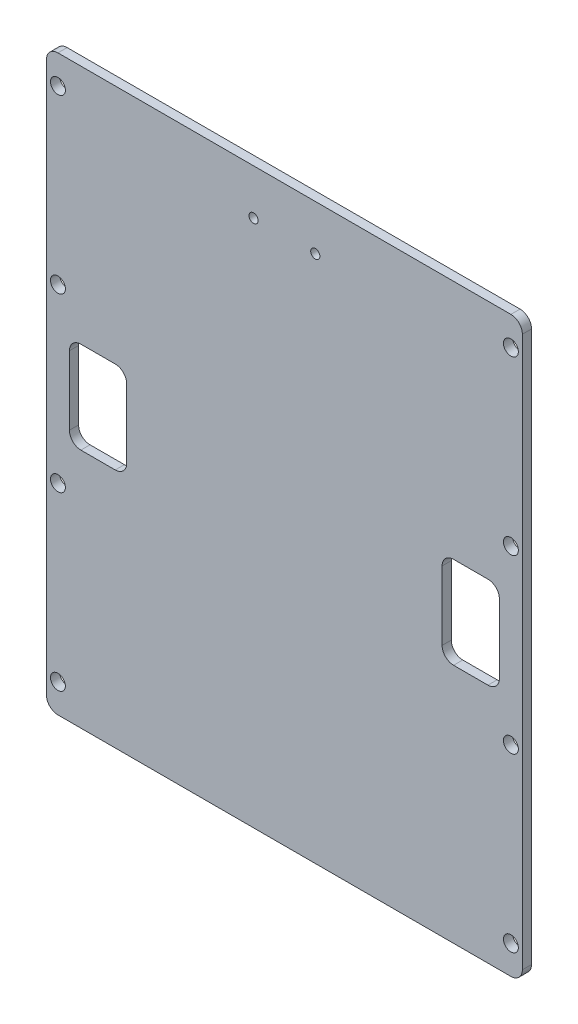
ISO-10303-21;
HEADER;
FILE_DESCRIPTION(('STEP AP214'),'2;1');
FILE_NAME('part.step','',(''),(''),'','','');
FILE_SCHEMA(('AUTOMOTIVE_DESIGN { 1 0 10303 214 1 1 1 1 }'));
ENDSEC;
DATA;
#1=APPLICATION_CONTEXT('core data for automotive mechanical design processes');
#2=APPLICATION_PROTOCOL_DEFINITION('international standard','automotive_design',2000,#1);
#3=PRODUCT_CONTEXT('',#1,'mechanical');
#4=PRODUCT('Part','Part','',(#3));
#5=PRODUCT_RELATED_PRODUCT_CATEGORY('part','',(#4));
#6=PRODUCT_DEFINITION_FORMATION('','',#4);
#7=PRODUCT_DEFINITION_CONTEXT('part definition',#1,'design');
#8=PRODUCT_DEFINITION('design','',#6,#7);
#9=PRODUCT_DEFINITION_SHAPE('','',#8);
#10=(LENGTH_UNIT() NAMED_UNIT(*) SI_UNIT(.MILLI.,.METRE.));
#11=(NAMED_UNIT(*) PLANE_ANGLE_UNIT() SI_UNIT($,.RADIAN.));
#12=(NAMED_UNIT(*) SI_UNIT($,.STERADIAN.) SOLID_ANGLE_UNIT());
#13=UNCERTAINTY_MEASURE_WITH_UNIT(LENGTH_MEASURE(1.E-05),#10,'distance_accuracy_value','');
#14=(GEOMETRIC_REPRESENTATION_CONTEXT(3) GLOBAL_UNCERTAINTY_ASSIGNED_CONTEXT((#13)) GLOBAL_UNIT_ASSIGNED_CONTEXT((#10,
#11,#12)) REPRESENTATION_CONTEXT('',''));
#15=CARTESIAN_POINT('',(0.,0.,0.));
#16=DIRECTION('',(0.,0.,1.));
#17=DIRECTION('',(1.,0.,0.));
#18=AXIS2_PLACEMENT_3D('',#15,#16,#17);
#19=CARTESIAN_POINT('',(-39.5,-48.,1.6));
#20=DIRECTION('',(0.,0.,-1.));
#21=DIRECTION('',(-1.,0.,0.));
#22=AXIS2_PLACEMENT_3D('',#19,#20,#21);
#23=CYLINDRICAL_SURFACE('',#22,2.);
#24=CARTESIAN_POINT('',(-39.5,-48.,0.));
#25=DIRECTION('',(0.,0.,1.));
#26=DIRECTION('',(-1.,0.,0.));
#27=AXIS2_PLACEMENT_3D('',#24,#25,#26);
#28=CIRCLE('',#27,2.);
#29=CARTESIAN_POINT('',(-41.5,-48.,0.));
#30=VERTEX_POINT('',#29);
#31=CARTESIAN_POINT('',(-39.5,-50.,0.));
#32=VERTEX_POINT('',#31);
#33=EDGE_CURVE('E395',#30,#32,#28,.T.);
#34=ORIENTED_EDGE('',*,*,#33,.T.);
#35=DIRECTION('',(0.,0.,-1.));
#36=VECTOR('',#35,1.);
#37=CARTESIAN_POINT('',(-39.5,-50.,1.6));
#38=LINE('',#37,#36);
#39=CARTESIAN_POINT('',(-39.5,-50.,1.6));
#40=VERTEX_POINT('',#39);
#41=EDGE_CURVE('E11',#40,#32,#38,.T.);
#42=ORIENTED_EDGE('',*,*,#41,.F.);
#43=CARTESIAN_POINT('',(-39.5,-48.,1.6));
#44=DIRECTION('',(0.,0.,1.));
#45=DIRECTION('',(-1.,0.,0.));
#46=AXIS2_PLACEMENT_3D('',#43,#44,#45);
#47=CIRCLE('',#46,2.);
#48=CARTESIAN_POINT('',(-41.5,-48.,1.6));
#49=VERTEX_POINT('',#48);
#50=EDGE_CURVE('E399',#49,#40,#47,.T.);
#51=ORIENTED_EDGE('',*,*,#50,.F.);
#52=DIRECTION('',(0.,0.,-1.));
#53=VECTOR('',#52,1.);
#54=CARTESIAN_POINT('',(-41.5,-48.,1.6));
#55=LINE('',#54,#53);
#56=EDGE_CURVE('E425',#49,#30,#55,.T.);
#57=ORIENTED_EDGE('',*,*,#56,.T.);
#58=EDGE_LOOP('',(#34,#42,#51,#57));
#59=FACE_BOUND('',#58,.T.);
#60=ADVANCED_FACE('F38',(#59),#23,.T.);
#61=CARTESIAN_POINT('',(-39.5,-50.,1.6));
#62=DIRECTION('',(0.,1.,0.));
#63=DIRECTION('',(0.,0.,1.));
#64=AXIS2_PLACEMENT_3D('',#61,#62,#63);
#65=PLANE('',#64);
#66=DIRECTION('',(1.,0.,0.));
#67=VECTOR('',#66,1.);
#68=CARTESIAN_POINT('',(-39.5,-50.,0.));
#69=LINE('',#68,#67);
#70=CARTESIAN_POINT('',(39.5,-50.,0.));
#71=VERTEX_POINT('',#70);
#72=EDGE_CURVE('E429',#32,#71,#69,.T.);
#73=ORIENTED_EDGE('',*,*,#72,.T.);
#74=DIRECTION('',(0.,0.,-1.));
#75=VECTOR('',#74,1.);
#76=CARTESIAN_POINT('',(39.5,-50.,1.6));
#77=LINE('',#76,#75);
#78=CARTESIAN_POINT('',(39.5,-50.,1.6));
#79=VERTEX_POINT('',#78);
#80=EDGE_CURVE('E46',#79,#71,#77,.T.);
#81=ORIENTED_EDGE('',*,*,#80,.F.);
#82=DIRECTION('',(1.,0.,0.));
#83=VECTOR('',#82,1.);
#84=CARTESIAN_POINT('',(-39.5,-50.,1.6));
#85=LINE('',#84,#83);
#86=EDGE_CURVE('E403',#40,#79,#85,.T.);
#87=ORIENTED_EDGE('',*,*,#86,.F.);
#88=ORIENTED_EDGE('',*,*,#41,.T.);
#89=EDGE_LOOP('',(#73,#81,#87,#88));
#90=FACE_BOUND('',#89,.T.);
#91=ADVANCED_FACE('F499',(#90),#65,.F.);
#92=CARTESIAN_POINT('',(39.5,-48.,1.6));
#93=DIRECTION('',(0.,0.,-1.));
#94=DIRECTION('',(-1.,0.,0.));
#95=AXIS2_PLACEMENT_3D('',#92,#93,#94);
#96=CYLINDRICAL_SURFACE('',#95,2.);
#97=CARTESIAN_POINT('',(39.5,-48.,0.));
#98=DIRECTION('',(0.,0.,1.));
#99=DIRECTION('',(1.,0.,0.));
#100=AXIS2_PLACEMENT_3D('',#97,#98,#99);
#101=CIRCLE('',#100,2.);
#102=CARTESIAN_POINT('',(41.5,-48.,0.));
#103=VERTEX_POINT('',#102);
#104=EDGE_CURVE('E432',#71,#103,#101,.T.);
#105=ORIENTED_EDGE('',*,*,#104,.T.);
#106=DIRECTION('',(0.,0.,-1.));
#107=VECTOR('',#106,1.);
#108=CARTESIAN_POINT('',(41.5,-48.,1.6));
#109=LINE('',#108,#107);
#110=CARTESIAN_POINT('',(41.5,-48.,1.6));
#111=VERTEX_POINT('',#110);
#112=EDGE_CURVE('E468',#111,#103,#109,.T.);
#113=ORIENTED_EDGE('',*,*,#112,.F.);
#114=CARTESIAN_POINT('',(39.5,-48.,1.6));
#115=DIRECTION('',(0.,0.,1.));
#116=DIRECTION('',(1.,0.,0.));
#117=AXIS2_PLACEMENT_3D('',#114,#115,#116);
#118=CIRCLE('',#117,2.);
#119=EDGE_CURVE('E407',#79,#111,#118,.T.);
#120=ORIENTED_EDGE('',*,*,#119,.F.);
#121=ORIENTED_EDGE('',*,*,#80,.T.);
#122=EDGE_LOOP('',(#105,#113,#120,#121));
#123=FACE_BOUND('',#122,.T.);
#124=ADVANCED_FACE('F477',(#123),#96,.T.);
#125=CARTESIAN_POINT('',(41.5,-48.,1.6));
#126=DIRECTION('',(-1.,0.,0.));
#127=DIRECTION('',(0.,0.,1.));
#128=AXIS2_PLACEMENT_3D('',#125,#126,#127);
#129=PLANE('',#128);
#130=DIRECTION('',(0.,1.,0.));
#131=VECTOR('',#130,1.);
#132=CARTESIAN_POINT('',(41.5,-48.,0.));
#133=LINE('',#132,#131);
#134=CARTESIAN_POINT('',(41.5,48.,0.));
#135=VERTEX_POINT('',#134);
#136=EDGE_CURVE('E435',#103,#135,#133,.T.);
#137=ORIENTED_EDGE('',*,*,#136,.T.);
#138=DIRECTION('',(0.,0.,-1.));
#139=VECTOR('',#138,1.);
#140=CARTESIAN_POINT('',(41.5,48.,1.6));
#141=LINE('',#140,#139);
#142=CARTESIAN_POINT('',(41.5,48.,1.6));
#143=VERTEX_POINT('',#142);
#144=EDGE_CURVE('E464',#143,#135,#141,.T.);
#145=ORIENTED_EDGE('',*,*,#144,.F.);
#146=DIRECTION('',(0.,1.,0.));
#147=VECTOR('',#146,1.);
#148=CARTESIAN_POINT('',(41.5,-48.,1.6));
#149=LINE('',#148,#147);
#150=EDGE_CURVE('E410',#111,#143,#149,.T.);
#151=ORIENTED_EDGE('',*,*,#150,.F.);
#152=ORIENTED_EDGE('',*,*,#112,.T.);
#153=EDGE_LOOP('',(#137,#145,#151,#152));
#154=FACE_BOUND('',#153,.T.);
#155=ADVANCED_FACE('F487',(#154),#129,.F.);
#156=CARTESIAN_POINT('',(39.5,48.,1.6));
#157=DIRECTION('',(0.,0.,-1.));
#158=DIRECTION('',(-1.,0.,0.));
#159=AXIS2_PLACEMENT_3D('',#156,#157,#158);
#160=CYLINDRICAL_SURFACE('',#159,2.);
#161=CARTESIAN_POINT('',(39.5,48.,0.));
#162=DIRECTION('',(0.,0.,1.));
#163=DIRECTION('',(-1.,0.,0.));
#164=AXIS2_PLACEMENT_3D('',#161,#162,#163);
#165=CIRCLE('',#164,2.);
#166=CARTESIAN_POINT('',(39.5,50.,0.));
#167=VERTEX_POINT('',#166);
#168=EDGE_CURVE('E438',#135,#167,#165,.T.);
#169=ORIENTED_EDGE('',*,*,#168,.T.);
#170=DIRECTION('',(0.,0.,-1.));
#171=VECTOR('',#170,1.);
#172=CARTESIAN_POINT('',(39.5,50.,1.6));
#173=LINE('',#172,#171);
#174=CARTESIAN_POINT('',(39.5,50.,1.6));
#175=VERTEX_POINT('',#174);
#176=EDGE_CURVE('E460',#175,#167,#173,.T.);
#177=ORIENTED_EDGE('',*,*,#176,.F.);
#178=CARTESIAN_POINT('',(39.5,48.,1.6));
#179=DIRECTION('',(0.,0.,1.));
#180=DIRECTION('',(-1.,0.,0.));
#181=AXIS2_PLACEMENT_3D('',#178,#179,#180);
#182=CIRCLE('',#181,2.);
#183=EDGE_CURVE('E413',#143,#175,#182,.T.);
#184=ORIENTED_EDGE('',*,*,#183,.F.);
#185=ORIENTED_EDGE('',*,*,#144,.T.);
#186=EDGE_LOOP('',(#169,#177,#184,#185));
#187=FACE_BOUND('',#186,.T.);
#188=ADVANCED_FACE('F491',(#187),#160,.T.);
#189=CARTESIAN_POINT('',(-39.5,50.,1.6));
#190=DIRECTION('',(0.,-1.,0.));
#191=DIRECTION('',(0.,0.,-1.));
#192=AXIS2_PLACEMENT_3D('',#189,#190,#191);
#193=PLANE('',#192);
#194=DIRECTION('',(-1.,0.,0.));
#195=VECTOR('',#194,1.);
#196=CARTESIAN_POINT('',(-39.5,50.,0.));
#197=LINE('',#196,#195);
#198=CARTESIAN_POINT('',(-39.5,50.,0.));
#199=VERTEX_POINT('',#198);
#200=EDGE_CURVE('E441',#167,#199,#197,.T.);
#201=ORIENTED_EDGE('',*,*,#200,.T.);
#202=DIRECTION('',(0.,0.,-1.));
#203=VECTOR('',#202,1.);
#204=CARTESIAN_POINT('',(-39.5,50.,1.6));
#205=LINE('',#204,#203);
#206=CARTESIAN_POINT('',(-39.5,50.,1.6));
#207=VERTEX_POINT('',#206);
#208=EDGE_CURVE('E456',#207,#199,#205,.T.);
#209=ORIENTED_EDGE('',*,*,#208,.F.);
#210=DIRECTION('',(-1.,0.,0.));
#211=VECTOR('',#210,1.);
#212=CARTESIAN_POINT('',(-39.5,50.,1.6));
#213=LINE('',#212,#211);
#214=EDGE_CURVE('E416',#175,#207,#213,.T.);
#215=ORIENTED_EDGE('',*,*,#214,.F.);
#216=ORIENTED_EDGE('',*,*,#176,.T.);
#217=EDGE_LOOP('',(#201,#209,#215,#216));
#218=FACE_BOUND('',#217,.T.);
#219=ADVANCED_FACE('F512',(#218),#193,.F.);
#220=CARTESIAN_POINT('',(-39.5,48.,1.6));
#221=DIRECTION('',(0.,0.,-1.));
#222=DIRECTION('',(-1.,0.,0.));
#223=AXIS2_PLACEMENT_3D('',#220,#221,#222);
#224=CYLINDRICAL_SURFACE('',#223,2.);
#225=CARTESIAN_POINT('',(-39.5,48.,0.));
#226=DIRECTION('',(0.,0.,1.));
#227=DIRECTION('',(-1.,0.,0.));
#228=AXIS2_PLACEMENT_3D('',#225,#226,#227);
#229=CIRCLE('',#228,2.);
#230=CARTESIAN_POINT('',(-41.5,48.,0.));
#231=VERTEX_POINT('',#230);
#232=EDGE_CURVE('E444',#199,#231,#229,.T.);
#233=ORIENTED_EDGE('',*,*,#232,.T.);
#234=DIRECTION('',(0.,0.,-1.));
#235=VECTOR('',#234,1.);
#236=CARTESIAN_POINT('',(-41.5,48.,1.6));
#237=LINE('',#236,#235);
#238=CARTESIAN_POINT('',(-41.5,48.,1.6));
#239=VERTEX_POINT('',#238);
#240=EDGE_CURVE('E452',#239,#231,#237,.T.);
#241=ORIENTED_EDGE('',*,*,#240,.F.);
#242=CARTESIAN_POINT('',(-39.5,48.,1.6));
#243=DIRECTION('',(0.,0.,1.));
#244=DIRECTION('',(-1.,0.,0.));
#245=AXIS2_PLACEMENT_3D('',#242,#243,#244);
#246=CIRCLE('',#245,2.);
#247=EDGE_CURVE('E419',#207,#239,#246,.T.);
#248=ORIENTED_EDGE('',*,*,#247,.F.);
#249=ORIENTED_EDGE('',*,*,#208,.T.);
#250=EDGE_LOOP('',(#233,#241,#248,#249));
#251=FACE_BOUND('',#250,.T.);
#252=ADVANCED_FACE('F510',(#251),#224,.T.);
#253=CARTESIAN_POINT('',(-41.5,-48.,1.6));
#254=DIRECTION('',(1.,0.,0.));
#255=DIRECTION('',(0.,0.,-1.));
#256=AXIS2_PLACEMENT_3D('',#253,#254,#255);
#257=PLANE('',#256);
#258=DIRECTION('',(0.,-1.,0.));
#259=VECTOR('',#258,1.);
#260=CARTESIAN_POINT('',(-41.5,-48.,0.));
#261=LINE('',#260,#259);
#262=EDGE_CURVE('E404',#231,#30,#261,.T.);
#263=ORIENTED_EDGE('',*,*,#262,.T.);
#264=ORIENTED_EDGE('',*,*,#56,.F.);
#265=DIRECTION('',(0.,-1.,0.));
#266=VECTOR('',#265,1.);
#267=CARTESIAN_POINT('',(-41.5,-48.,1.6));
#268=LINE('',#267,#266);
#269=EDGE_CURVE('E422',#239,#49,#268,.T.);
#270=ORIENTED_EDGE('',*,*,#269,.F.);
#271=ORIENTED_EDGE('',*,*,#240,.T.);
#272=EDGE_LOOP('',(#263,#264,#270,#271));
#273=FACE_BOUND('',#272,.T.);
#274=ADVANCED_FACE('F505',(#273),#257,.F.);
#275=CARTESIAN_POINT('',(-39.5,-48.,1.6));
#276=DIRECTION('',(0.,0.,-1.));
#277=DIRECTION('',(-1.,0.,0.));
#278=AXIS2_PLACEMENT_3D('',#275,#276,#277);
#279=PLANE('',#278);
#280=CARTESIAN_POINT('',(39.5,45.,1.6));
#281=DIRECTION('',(0.,0.,-1.));
#282=DIRECTION('',(-1.,0.,0.));
#283=AXIS2_PLACEMENT_3D('',#280,#281,#282);
#284=CIRCLE('',#283,1.3);
#285=CARTESIAN_POINT('',(38.2,45.,1.6));
#286=VERTEX_POINT('',#285);
#287=EDGE_CURVE('E891',#286,#286,#284,.T.);
#288=ORIENTED_EDGE('',*,*,#287,.T.);
#289=EDGE_LOOP('',(#288));
#290=FACE_BOUND('',#289,.T.);
#291=CARTESIAN_POINT('',(39.5,-15.,1.6));
#292=DIRECTION('',(0.,0.,-1.));
#293=DIRECTION('',(-1.,0.,0.));
#294=AXIS2_PLACEMENT_3D('',#291,#292,#293);
#295=CIRCLE('',#294,1.3);
#296=CARTESIAN_POINT('',(38.2,-15.,1.6));
#297=VERTEX_POINT('',#296);
#298=EDGE_CURVE('E905',#297,#297,#295,.T.);
#299=ORIENTED_EDGE('',*,*,#298,.T.);
#300=EDGE_LOOP('',(#299));
#301=FACE_BOUND('',#300,.T.);
#302=CARTESIAN_POINT('',(39.5,-45.,1.6));
#303=DIRECTION('',(0.,0.,-1.));
#304=DIRECTION('',(-1.,0.,0.));
#305=AXIS2_PLACEMENT_3D('',#302,#303,#304);
#306=CIRCLE('',#305,1.3);
#307=CARTESIAN_POINT('',(38.2,-45.,1.6));
#308=VERTEX_POINT('',#307);
#309=EDGE_CURVE('E913',#308,#308,#306,.T.);
#310=ORIENTED_EDGE('',*,*,#309,.T.);
#311=EDGE_LOOP('',(#310));
#312=FACE_BOUND('',#311,.T.);
#313=CARTESIAN_POINT('',(39.5,15.,1.6));
#314=DIRECTION('',(0.,0.,-1.));
#315=DIRECTION('',(-1.,0.,0.));
#316=AXIS2_PLACEMENT_3D('',#313,#314,#315);
#317=CIRCLE('',#316,1.3);
#318=CARTESIAN_POINT('',(38.2,15.,1.6));
#319=VERTEX_POINT('',#318);
#320=EDGE_CURVE('E920',#319,#319,#317,.T.);
#321=ORIENTED_EDGE('',*,*,#320,.T.);
#322=EDGE_LOOP('',(#321));
#323=FACE_BOUND('',#322,.T.);
#324=CARTESIAN_POINT('',(-39.5,45.,1.6));
#325=DIRECTION('',(0.,0.,-1.));
#326=DIRECTION('',(-1.,0.,0.));
#327=AXIS2_PLACEMENT_3D('',#324,#325,#326);
#328=CIRCLE('',#327,1.3);
#329=CARTESIAN_POINT('',(-40.8,45.,1.6));
#330=VERTEX_POINT('',#329);
#331=EDGE_CURVE('E928',#330,#330,#328,.T.);
#332=ORIENTED_EDGE('',*,*,#331,.T.);
#333=EDGE_LOOP('',(#332));
#334=FACE_BOUND('',#333,.T.);
#335=CARTESIAN_POINT('',(-39.5,-15.,1.6));
#336=DIRECTION('',(0.,0.,-1.));
#337=DIRECTION('',(-1.,0.,0.));
#338=AXIS2_PLACEMENT_3D('',#335,#336,#337);
#339=CIRCLE('',#338,1.3);
#340=CARTESIAN_POINT('',(-40.8,-15.,1.6));
#341=VERTEX_POINT('',#340);
#342=EDGE_CURVE('E936',#341,#341,#339,.T.);
#343=ORIENTED_EDGE('',*,*,#342,.T.);
#344=EDGE_LOOP('',(#343));
#345=FACE_BOUND('',#344,.T.);
#346=CARTESIAN_POINT('',(-39.5,-45.,1.6));
#347=DIRECTION('',(0.,0.,-1.));
#348=DIRECTION('',(-1.,0.,0.));
#349=AXIS2_PLACEMENT_3D('',#346,#347,#348);
#350=CIRCLE('',#349,1.3);
#351=CARTESIAN_POINT('',(-40.8,-45.,1.6));
#352=VERTEX_POINT('',#351);
#353=EDGE_CURVE('E944',#352,#352,#350,.T.);
#354=ORIENTED_EDGE('',*,*,#353,.T.);
#355=EDGE_LOOP('',(#354));
#356=FACE_BOUND('',#355,.T.);
#357=CARTESIAN_POINT('',(-39.5,15.,1.6));
#358=DIRECTION('',(0.,0.,-1.));
#359=DIRECTION('',(-1.,0.,0.));
#360=AXIS2_PLACEMENT_3D('',#357,#358,#359);
#361=CIRCLE('',#360,1.3);
#362=CARTESIAN_POINT('',(-40.8,15.,1.6));
#363=VERTEX_POINT('',#362);
#364=EDGE_CURVE('E230',#363,#363,#361,.T.);
#365=ORIENTED_EDGE('',*,*,#364,.T.);
#366=EDGE_LOOP('',(#365));
#367=FACE_BOUND('',#366,.T.);
#368=DIRECTION('',(0.,1.,0.));
#369=VECTOR('',#368,1.);
#370=CARTESIAN_POINT('',(-27.5,-6.,1.6));
#371=LINE('',#370,#369);
#372=CARTESIAN_POINT('',(-27.5,-6.,1.6));
#373=VERTEX_POINT('',#372);
#374=CARTESIAN_POINT('',(-27.5,6.,1.6));
#375=VERTEX_POINT('',#374);
#376=EDGE_CURVE('E254',#373,#375,#371,.T.);
#377=ORIENTED_EDGE('',*,*,#376,.F.);
#378=CARTESIAN_POINT('',(-29.5,-6.,1.6));
#379=DIRECTION('',(0.,0.,1.));
#380=DIRECTION('',(1.,0.,0.));
#381=AXIS2_PLACEMENT_3D('',#378,#379,#380);
#382=CIRCLE('',#381,2.);
#383=CARTESIAN_POINT('',(-29.5,-8.,1.6));
#384=VERTEX_POINT('',#383);
#385=EDGE_CURVE('E53',#384,#373,#382,.T.);
#386=ORIENTED_EDGE('',*,*,#385,.F.);
#387=DIRECTION('',(1.,0.,0.));
#388=VECTOR('',#387,1.);
#389=CARTESIAN_POINT('',(-29.5,-8.,1.6));
#390=LINE('',#389,#388);
#391=CARTESIAN_POINT('',(-35.5,-8.,1.6));
#392=VERTEX_POINT('',#391);
#393=EDGE_CURVE('E221',#392,#384,#390,.T.);
#394=ORIENTED_EDGE('',*,*,#393,.F.);
#395=CARTESIAN_POINT('',(-35.5,-6.,1.6));
#396=DIRECTION('',(0.,0.,1.));
#397=DIRECTION('',(-1.,0.,0.));
#398=AXIS2_PLACEMENT_3D('',#395,#396,#397);
#399=CIRCLE('',#398,2.);
#400=CARTESIAN_POINT('',(-37.5,-6.,1.6));
#401=VERTEX_POINT('',#400);
#402=EDGE_CURVE('E227',#401,#392,#399,.T.);
#403=ORIENTED_EDGE('',*,*,#402,.F.);
#404=DIRECTION('',(0.,-1.,0.));
#405=VECTOR('',#404,1.);
#406=CARTESIAN_POINT('',(-37.5,-6.,1.6));
#407=LINE('',#406,#405);
#408=CARTESIAN_POINT('',(-37.5,6.,1.6));
#409=VERTEX_POINT('',#408);
#410=EDGE_CURVE('E269',#409,#401,#407,.T.);
#411=ORIENTED_EDGE('',*,*,#410,.F.);
#412=CARTESIAN_POINT('',(-35.5,6.,1.6));
#413=DIRECTION('',(0.,0.,1.));
#414=DIRECTION('',(1.,0.,0.));
#415=AXIS2_PLACEMENT_3D('',#412,#413,#414);
#416=CIRCLE('',#415,2.);
#417=CARTESIAN_POINT('',(-35.5,8.,1.6));
#418=VERTEX_POINT('',#417);
#419=EDGE_CURVE('E265',#418,#409,#416,.T.);
#420=ORIENTED_EDGE('',*,*,#419,.F.);
#421=DIRECTION('',(-1.,0.,0.));
#422=VECTOR('',#421,1.);
#423=CARTESIAN_POINT('',(-29.5,8.,1.6));
#424=LINE('',#423,#422);
#425=CARTESIAN_POINT('',(-29.5,8.,1.6));
#426=VERTEX_POINT('',#425);
#427=EDGE_CURVE('E261',#426,#418,#424,.T.);
#428=ORIENTED_EDGE('',*,*,#427,.F.);
#429=CARTESIAN_POINT('',(-29.5,6.,1.6));
#430=DIRECTION('',(0.,0.,1.));
#431=DIRECTION('',(1.,0.,0.));
#432=AXIS2_PLACEMENT_3D('',#429,#430,#431);
#433=CIRCLE('',#432,2.);
#434=EDGE_CURVE('E257',#375,#426,#433,.T.);
#435=ORIENTED_EDGE('',*,*,#434,.F.);
#436=EDGE_LOOP('',(#377,#386,#394,#403,#411,#420,#428,#435));
#437=FACE_BOUND('',#436,.T.);
#438=DIRECTION('',(0.,-1.,0.));
#439=VECTOR('',#438,1.);
#440=CARTESIAN_POINT('',(27.5,-6.,1.6));
#441=LINE('',#440,#439);
#442=CARTESIAN_POINT('',(27.5,6.,1.6));
#443=VERTEX_POINT('',#442);
#444=CARTESIAN_POINT('',(27.5,-6.,1.6));
#445=VERTEX_POINT('',#444);
#446=EDGE_CURVE('E332',#443,#445,#441,.T.);
#447=ORIENTED_EDGE('',*,*,#446,.F.);
#448=CARTESIAN_POINT('',(29.5,6.,1.6));
#449=DIRECTION('',(0.,0.,1.));
#450=DIRECTION('',(-1.,0.,0.));
#451=AXIS2_PLACEMENT_3D('',#448,#449,#450);
#452=CIRCLE('',#451,2.);
#453=CARTESIAN_POINT('',(29.5,8.,1.6));
#454=VERTEX_POINT('',#453);
#455=EDGE_CURVE('E279',#454,#443,#452,.T.);
#456=ORIENTED_EDGE('',*,*,#455,.F.);
#457=DIRECTION('',(-1.,0.,0.));
#458=VECTOR('',#457,1.);
#459=CARTESIAN_POINT('',(29.5,8.,1.6));
#460=LINE('',#459,#458);
#461=CARTESIAN_POINT('',(35.5,8.,1.6));
#462=VERTEX_POINT('',#461);
#463=EDGE_CURVE('E302',#462,#454,#460,.T.);
#464=ORIENTED_EDGE('',*,*,#463,.F.);
#465=CARTESIAN_POINT('',(35.5,6.,1.6));
#466=DIRECTION('',(0.,0.,1.));
#467=DIRECTION('',(-1.,0.,0.));
#468=AXIS2_PLACEMENT_3D('',#465,#466,#467);
#469=CIRCLE('',#468,2.);
#470=CARTESIAN_POINT('',(37.5,6.,1.6));
#471=VERTEX_POINT('',#470);
#472=EDGE_CURVE('E352',#471,#462,#469,.T.);
#473=ORIENTED_EDGE('',*,*,#472,.F.);
#474=DIRECTION('',(0.,1.,0.));
#475=VECTOR('',#474,1.);
#476=CARTESIAN_POINT('',(37.5,-6.,1.6));
#477=LINE('',#476,#475);
#478=CARTESIAN_POINT('',(37.5,-6.,1.6));
#479=VERTEX_POINT('',#478);
#480=EDGE_CURVE('E348',#479,#471,#477,.T.);
#481=ORIENTED_EDGE('',*,*,#480,.F.);
#482=CARTESIAN_POINT('',(35.5,-6.,1.6));
#483=DIRECTION('',(0.,0.,1.));
#484=DIRECTION('',(1.,0.,0.));
#485=AXIS2_PLACEMENT_3D('',#482,#483,#484);
#486=CIRCLE('',#485,2.);
#487=CARTESIAN_POINT('',(35.5,-8.,1.6));
#488=VERTEX_POINT('',#487);
#489=EDGE_CURVE('E344',#488,#479,#486,.T.);
#490=ORIENTED_EDGE('',*,*,#489,.F.);
#491=DIRECTION('',(1.,0.,0.));
#492=VECTOR('',#491,1.);
#493=CARTESIAN_POINT('',(29.5,-8.,1.6));
#494=LINE('',#493,#492);
#495=CARTESIAN_POINT('',(29.5,-8.,1.6));
#496=VERTEX_POINT('',#495);
#497=EDGE_CURVE('E340',#496,#488,#494,.T.);
#498=ORIENTED_EDGE('',*,*,#497,.F.);
#499=CARTESIAN_POINT('',(29.5,-6.,1.6));
#500=DIRECTION('',(0.,0.,1.));
#501=DIRECTION('',(-1.,0.,0.));
#502=AXIS2_PLACEMENT_3D('',#499,#500,#501);
#503=CIRCLE('',#502,2.);
#504=EDGE_CURVE('E336',#445,#496,#503,.T.);
#505=ORIENTED_EDGE('',*,*,#504,.F.);
#506=EDGE_LOOP('',(#447,#456,#464,#473,#481,#490,#498,#505));
#507=FACE_BOUND('',#506,.T.);
#508=CARTESIAN_POINT('',(5.385,42.1,1.6));
#509=DIRECTION('',(0.,0.,1.));
#510=DIRECTION('',(1.,0.,0.));
#511=AXIS2_PLACEMENT_3D('',#508,#509,#510);
#512=CIRCLE('',#511,0.800000000000002);
#513=CARTESIAN_POINT('',(6.185,42.1,1.6));
#514=VERTEX_POINT('',#513);
#515=EDGE_CURVE('E362',#514,#514,#512,.T.);
#516=ORIENTED_EDGE('',*,*,#515,.F.);
#517=EDGE_LOOP('',(#516));
#518=FACE_BOUND('',#517,.T.);
#519=CARTESIAN_POINT('',(-5.385,42.1,1.6));
#520=DIRECTION('',(0.,0.,1.));
#521=DIRECTION('',(1.,0.,0.));
#522=AXIS2_PLACEMENT_3D('',#519,#520,#521);
#523=CIRCLE('',#522,0.800000000000001);
#524=CARTESIAN_POINT('',(-4.585,42.1,1.6));
#525=VERTEX_POINT('',#524);
#526=EDGE_CURVE('E387',#525,#525,#523,.T.);
#527=ORIENTED_EDGE('',*,*,#526,.F.);
#528=EDGE_LOOP('',(#527));
#529=FACE_BOUND('',#528,.T.);
#530=ORIENTED_EDGE('',*,*,#50,.T.);
#531=ORIENTED_EDGE('',*,*,#86,.T.);
#532=ORIENTED_EDGE('',*,*,#119,.T.);
#533=ORIENTED_EDGE('',*,*,#150,.T.);
#534=ORIENTED_EDGE('',*,*,#183,.T.);
#535=ORIENTED_EDGE('',*,*,#214,.T.);
#536=ORIENTED_EDGE('',*,*,#247,.T.);
#537=ORIENTED_EDGE('',*,*,#269,.T.);
#538=EDGE_LOOP('',(#530,#531,#532,#533,#534,#535,#536,#537));
#539=FACE_BOUND('',#538,.T.);
#540=ADVANCED_FACE('F495',(#290,#301,#312,#323,#334,#345,#356,#367,#437,#507,#518,#529,#539),
#279,.F.);
#541=CARTESIAN_POINT('',(-39.5,-48.,0.));
#542=DIRECTION('',(0.,0.,-1.));
#543=DIRECTION('',(-1.,0.,0.));
#544=AXIS2_PLACEMENT_3D('',#541,#542,#543);
#545=PLANE('',#544);
#546=CARTESIAN_POINT('',(39.5,45.,0.));
#547=DIRECTION('',(0.,0.,-1.));
#548=DIRECTION('',(-1.,0.,0.));
#549=AXIS2_PLACEMENT_3D('',#546,#547,#548);
#550=CIRCLE('',#549,1.3);
#551=CARTESIAN_POINT('',(38.2,45.,0.));
#552=VERTEX_POINT('',#551);
#553=EDGE_CURVE('E894',#552,#552,#550,.T.);
#554=ORIENTED_EDGE('',*,*,#553,.F.);
#555=EDGE_LOOP('',(#554));
#556=FACE_BOUND('',#555,.T.);
#557=CARTESIAN_POINT('',(39.5,-15.,0.));
#558=DIRECTION('',(0.,0.,-1.));
#559=DIRECTION('',(-1.,0.,0.));
#560=AXIS2_PLACEMENT_3D('',#557,#558,#559);
#561=CIRCLE('',#560,1.3);
#562=CARTESIAN_POINT('',(38.2,-15.,0.));
#563=VERTEX_POINT('',#562);
#564=EDGE_CURVE('E899',#563,#563,#561,.T.);
#565=ORIENTED_EDGE('',*,*,#564,.F.);
#566=EDGE_LOOP('',(#565));
#567=FACE_BOUND('',#566,.T.);
#568=CARTESIAN_POINT('',(39.5,-45.,0.));
#569=DIRECTION('',(0.,0.,-1.));
#570=DIRECTION('',(-1.,0.,0.));
#571=AXIS2_PLACEMENT_3D('',#568,#569,#570);
#572=CIRCLE('',#571,1.3);
#573=CARTESIAN_POINT('',(38.2,-45.,0.));
#574=VERTEX_POINT('',#573);
#575=EDGE_CURVE('E909',#574,#574,#572,.T.);
#576=ORIENTED_EDGE('',*,*,#575,.F.);
#577=EDGE_LOOP('',(#576));
#578=FACE_BOUND('',#577,.T.);
#579=CARTESIAN_POINT('',(39.5,15.,0.));
#580=DIRECTION('',(0.,0.,-1.));
#581=DIRECTION('',(-1.,0.,0.));
#582=AXIS2_PLACEMENT_3D('',#579,#580,#581);
#583=CIRCLE('',#582,1.3);
#584=CARTESIAN_POINT('',(38.2,15.,0.));
#585=VERTEX_POINT('',#584);
#586=EDGE_CURVE('E917',#585,#585,#583,.T.);
#587=ORIENTED_EDGE('',*,*,#586,.F.);
#588=EDGE_LOOP('',(#587));
#589=FACE_BOUND('',#588,.T.);
#590=CARTESIAN_POINT('',(-39.5,45.,0.));
#591=DIRECTION('',(0.,0.,-1.));
#592=DIRECTION('',(-1.,0.,0.));
#593=AXIS2_PLACEMENT_3D('',#590,#591,#592);
#594=CIRCLE('',#593,1.3);
#595=CARTESIAN_POINT('',(-40.8,45.,0.));
#596=VERTEX_POINT('',#595);
#597=EDGE_CURVE('E924',#596,#596,#594,.T.);
#598=ORIENTED_EDGE('',*,*,#597,.F.);
#599=EDGE_LOOP('',(#598));
#600=FACE_BOUND('',#599,.T.);
#601=CARTESIAN_POINT('',(-39.5,-15.,0.));
#602=DIRECTION('',(0.,0.,-1.));
#603=DIRECTION('',(-1.,0.,0.));
#604=AXIS2_PLACEMENT_3D('',#601,#602,#603);
#605=CIRCLE('',#604,1.3);
#606=CARTESIAN_POINT('',(-40.8,-15.,0.));
#607=VERTEX_POINT('',#606);
#608=EDGE_CURVE('E932',#607,#607,#605,.T.);
#609=ORIENTED_EDGE('',*,*,#608,.F.);
#610=EDGE_LOOP('',(#609));
#611=FACE_BOUND('',#610,.T.);
#612=CARTESIAN_POINT('',(-39.5,-45.,0.));
#613=DIRECTION('',(0.,0.,-1.));
#614=DIRECTION('',(-1.,0.,0.));
#615=AXIS2_PLACEMENT_3D('',#612,#613,#614);
#616=CIRCLE('',#615,1.3);
#617=CARTESIAN_POINT('',(-40.8,-45.,0.));
#618=VERTEX_POINT('',#617);
#619=EDGE_CURVE('E940',#618,#618,#616,.T.);
#620=ORIENTED_EDGE('',*,*,#619,.F.);
#621=EDGE_LOOP('',(#620));
#622=FACE_BOUND('',#621,.T.);
#623=CARTESIAN_POINT('',(-39.5,15.,0.));
#624=DIRECTION('',(0.,0.,-1.));
#625=DIRECTION('',(-1.,0.,0.));
#626=AXIS2_PLACEMENT_3D('',#623,#624,#625);
#627=CIRCLE('',#626,1.3);
#628=CARTESIAN_POINT('',(-40.8,15.,0.));
#629=VERTEX_POINT('',#628);
#630=EDGE_CURVE('E947',#629,#629,#627,.T.);
#631=ORIENTED_EDGE('',*,*,#630,.F.);
#632=EDGE_LOOP('',(#631));
#633=FACE_BOUND('',#632,.T.);
#634=CARTESIAN_POINT('',(-29.5,-6.,0.));
#635=DIRECTION('',(0.,0.,1.));
#636=DIRECTION('',(1.,0.,0.));
#637=AXIS2_PLACEMENT_3D('',#634,#635,#636);
#638=CIRCLE('',#637,2.);
#639=CARTESIAN_POINT('',(-29.5,-8.,0.));
#640=VERTEX_POINT('',#639);
#641=CARTESIAN_POINT('',(-27.5,-6.,0.));
#642=VERTEX_POINT('',#641);
#643=EDGE_CURVE('E201',#640,#642,#638,.T.);
#644=ORIENTED_EDGE('',*,*,#643,.T.);
#645=DIRECTION('',(0.,1.,0.));
#646=VECTOR('',#645,1.);
#647=CARTESIAN_POINT('',(-27.5,-6.,0.));
#648=LINE('',#647,#646);
#649=CARTESIAN_POINT('',(-27.5,6.,0.));
#650=VERTEX_POINT('',#649);
#651=EDGE_CURVE('E211',#642,#650,#648,.T.);
#652=ORIENTED_EDGE('',*,*,#651,.T.);
#653=CARTESIAN_POINT('',(-29.5,6.,0.));
#654=DIRECTION('',(0.,0.,1.));
#655=DIRECTION('',(1.,0.,0.));
#656=AXIS2_PLACEMENT_3D('',#653,#654,#655);
#657=CIRCLE('',#656,2.);
#658=CARTESIAN_POINT('',(-29.5,8.,0.));
#659=VERTEX_POINT('',#658);
#660=EDGE_CURVE('E61',#650,#659,#657,.T.);
#661=ORIENTED_EDGE('',*,*,#660,.T.);
#662=DIRECTION('',(-1.,0.,0.));
#663=VECTOR('',#662,1.);
#664=CARTESIAN_POINT('',(-29.5,8.,0.));
#665=LINE('',#664,#663);
#666=CARTESIAN_POINT('',(-35.5,8.,0.));
#667=VERTEX_POINT('',#666);
#668=EDGE_CURVE('E235',#659,#667,#665,.T.);
#669=ORIENTED_EDGE('',*,*,#668,.T.);
#670=CARTESIAN_POINT('',(-35.5,6.,0.));
#671=DIRECTION('',(0.,0.,1.));
#672=DIRECTION('',(1.,0.,0.));
#673=AXIS2_PLACEMENT_3D('',#670,#671,#672);
#674=CIRCLE('',#673,2.);
#675=CARTESIAN_POINT('',(-37.5,6.,0.));
#676=VERTEX_POINT('',#675);
#677=EDGE_CURVE('E239',#667,#676,#674,.T.);
#678=ORIENTED_EDGE('',*,*,#677,.T.);
#679=DIRECTION('',(0.,-1.,0.));
#680=VECTOR('',#679,1.);
#681=CARTESIAN_POINT('',(-37.5,-6.,0.));
#682=LINE('',#681,#680);
#683=CARTESIAN_POINT('',(-37.5,-6.,0.));
#684=VERTEX_POINT('',#683);
#685=EDGE_CURVE('E243',#676,#684,#682,.T.);
#686=ORIENTED_EDGE('',*,*,#685,.T.);
#687=CARTESIAN_POINT('',(-35.5,-6.,0.));
#688=DIRECTION('',(0.,0.,1.));
#689=DIRECTION('',(-1.,0.,0.));
#690=AXIS2_PLACEMENT_3D('',#687,#688,#689);
#691=CIRCLE('',#690,2.);
#692=CARTESIAN_POINT('',(-35.5,-8.,0.));
#693=VERTEX_POINT('',#692);
#694=EDGE_CURVE('E247',#684,#693,#691,.T.);
#695=ORIENTED_EDGE('',*,*,#694,.T.);
#696=DIRECTION('',(1.,0.,0.));
#697=VECTOR('',#696,1.);
#698=CARTESIAN_POINT('',(-29.5,-8.,0.));
#699=LINE('',#698,#697);
#700=EDGE_CURVE('E208',#693,#640,#699,.T.);
#701=ORIENTED_EDGE('',*,*,#700,.T.);
#702=EDGE_LOOP('',(#644,#652,#661,#669,#678,#686,#695,#701));
#703=FACE_BOUND('',#702,.T.);
#704=CARTESIAN_POINT('',(29.5,6.,0.));
#705=DIRECTION('',(0.,0.,1.));
#706=DIRECTION('',(-1.,0.,0.));
#707=AXIS2_PLACEMENT_3D('',#704,#705,#706);
#708=CIRCLE('',#707,2.);
#709=CARTESIAN_POINT('',(29.5,8.,0.));
#710=VERTEX_POINT('',#709);
#711=CARTESIAN_POINT('',(27.5,6.,0.));
#712=VERTEX_POINT('',#711);
#713=EDGE_CURVE('E297',#710,#712,#708,.T.);
#714=ORIENTED_EDGE('',*,*,#713,.T.);
#715=DIRECTION('',(0.,-1.,0.));
#716=VECTOR('',#715,1.);
#717=CARTESIAN_POINT('',(27.5,-6.,0.));
#718=LINE('',#717,#716);
#719=CARTESIAN_POINT('',(27.5,-6.,0.));
#720=VERTEX_POINT('',#719);
#721=EDGE_CURVE('E301',#712,#720,#718,.T.);
#722=ORIENTED_EDGE('',*,*,#721,.T.);
#723=CARTESIAN_POINT('',(29.5,-6.,0.));
#724=DIRECTION('',(0.,0.,1.));
#725=DIRECTION('',(-1.,0.,0.));
#726=AXIS2_PLACEMENT_3D('',#723,#724,#725);
#727=CIRCLE('',#726,2.);
#728=CARTESIAN_POINT('',(29.5,-8.,0.));
#729=VERTEX_POINT('',#728);
#730=EDGE_CURVE('E306',#720,#729,#727,.T.);
#731=ORIENTED_EDGE('',*,*,#730,.T.);
#732=DIRECTION('',(1.,0.,0.));
#733=VECTOR('',#732,1.);
#734=CARTESIAN_POINT('',(29.5,-8.,0.));
#735=LINE('',#734,#733);
#736=CARTESIAN_POINT('',(35.5,-8.,0.));
#737=VERTEX_POINT('',#736);
#738=EDGE_CURVE('E310',#729,#737,#735,.T.);
#739=ORIENTED_EDGE('',*,*,#738,.T.);
#740=CARTESIAN_POINT('',(35.5,-6.,0.));
#741=DIRECTION('',(0.,0.,1.));
#742=DIRECTION('',(1.,0.,0.));
#743=AXIS2_PLACEMENT_3D('',#740,#741,#742);
#744=CIRCLE('',#743,2.);
#745=CARTESIAN_POINT('',(37.5,-6.,0.));
#746=VERTEX_POINT('',#745);
#747=EDGE_CURVE('E314',#737,#746,#744,.T.);
#748=ORIENTED_EDGE('',*,*,#747,.T.);
#749=DIRECTION('',(0.,1.,0.));
#750=VECTOR('',#749,1.);
#751=CARTESIAN_POINT('',(37.5,-6.,0.));
#752=LINE('',#751,#750);
#753=CARTESIAN_POINT('',(37.5,6.,0.));
#754=VERTEX_POINT('',#753);
#755=EDGE_CURVE('E318',#746,#754,#752,.T.);
#756=ORIENTED_EDGE('',*,*,#755,.T.);
#757=CARTESIAN_POINT('',(35.5,6.,0.));
#758=DIRECTION('',(0.,0.,1.));
#759=DIRECTION('',(-1.,0.,0.));
#760=AXIS2_PLACEMENT_3D('',#757,#758,#759);
#761=CIRCLE('',#760,2.);
#762=CARTESIAN_POINT('',(35.5,8.,0.));
#763=VERTEX_POINT('',#762);
#764=EDGE_CURVE('E322',#754,#763,#761,.T.);
#765=ORIENTED_EDGE('',*,*,#764,.T.);
#766=DIRECTION('',(-1.,0.,0.));
#767=VECTOR('',#766,1.);
#768=CARTESIAN_POINT('',(29.5,8.,0.));
#769=LINE('',#768,#767);
#770=EDGE_CURVE('E326',#763,#710,#769,.T.);
#771=ORIENTED_EDGE('',*,*,#770,.T.);
#772=EDGE_LOOP('',(#714,#722,#731,#739,#748,#756,#765,#771));
#773=FACE_BOUND('',#772,.T.);
#774=CARTESIAN_POINT('',(5.385,42.1,0.));
#775=DIRECTION('',(0.,0.,1.));
#776=DIRECTION('',(1.,0.,0.));
#777=AXIS2_PLACEMENT_3D('',#774,#775,#776);
#778=CIRCLE('',#777,0.800000000000002);
#779=CARTESIAN_POINT('',(6.185,42.1,0.));
#780=VERTEX_POINT('',#779);
#781=EDGE_CURVE('E384',#780,#780,#778,.T.);
#782=ORIENTED_EDGE('',*,*,#781,.T.);
#783=EDGE_LOOP('',(#782));
#784=FACE_BOUND('',#783,.T.);
#785=CARTESIAN_POINT('',(-5.385,42.1,0.));
#786=DIRECTION('',(0.,0.,1.));
#787=DIRECTION('',(1.,0.,0.));
#788=AXIS2_PLACEMENT_3D('',#785,#786,#787);
#789=CIRCLE('',#788,0.800000000000001);
#790=CARTESIAN_POINT('',(-4.585,42.1,0.));
#791=VERTEX_POINT('',#790);
#792=EDGE_CURVE('E391',#791,#791,#789,.T.);
#793=ORIENTED_EDGE('',*,*,#792,.T.);
#794=EDGE_LOOP('',(#793));
#795=FACE_BOUND('',#794,.T.);
#796=ORIENTED_EDGE('',*,*,#33,.F.);
#797=ORIENTED_EDGE('',*,*,#262,.F.);
#798=ORIENTED_EDGE('',*,*,#232,.F.);
#799=ORIENTED_EDGE('',*,*,#200,.F.);
#800=ORIENTED_EDGE('',*,*,#168,.F.);
#801=ORIENTED_EDGE('',*,*,#136,.F.);
#802=ORIENTED_EDGE('',*,*,#104,.F.);
#803=ORIENTED_EDGE('',*,*,#72,.F.);
#804=EDGE_LOOP('',(#796,#797,#798,#799,#800,#801,#802,#803));
#805=FACE_BOUND('',#804,.T.);
#806=ADVANCED_FACE('F216',(#556,#567,#578,#589,#600,#611,#622,#633,#703,#773,#784,#795,#805),
#545,.T.);
#807=CARTESIAN_POINT('',(-5.385,42.1,0.));
#808=DIRECTION('',(0.,0.,1.));
#809=DIRECTION('',(1.,0.,0.));
#810=AXIS2_PLACEMENT_3D('',#807,#808,#809);
#811=CYLINDRICAL_SURFACE('',#810,0.800000000000001);
#812=ORIENTED_EDGE('',*,*,#792,.F.);
#813=EDGE_LOOP('',(#812));
#814=FACE_BOUND('',#813,.T.);
#815=ORIENTED_EDGE('',*,*,#526,.T.);
#816=EDGE_LOOP('',(#815));
#817=FACE_BOUND('',#816,.T.);
#818=ADVANCED_FACE('F569',(#814,#817),#811,.F.);
#819=CARTESIAN_POINT('',(5.385,42.1,0.));
#820=DIRECTION('',(0.,0.,1.));
#821=DIRECTION('',(1.,0.,0.));
#822=AXIS2_PLACEMENT_3D('',#819,#820,#821);
#823=CYLINDRICAL_SURFACE('',#822,0.800000000000002);
#824=ORIENTED_EDGE('',*,*,#781,.F.);
#825=EDGE_LOOP('',(#824));
#826=FACE_BOUND('',#825,.T.);
#827=ORIENTED_EDGE('',*,*,#515,.T.);
#828=EDGE_LOOP('',(#827));
#829=FACE_BOUND('',#828,.T.);
#830=ADVANCED_FACE('F577',(#826,#829),#823,.F.);
#831=CARTESIAN_POINT('',(29.5,6.,0.));
#832=DIRECTION('',(0.,0.,1.));
#833=DIRECTION('',(1.,0.,0.));
#834=AXIS2_PLACEMENT_3D('',#831,#832,#833);
#835=CYLINDRICAL_SURFACE('',#834,2.);
#836=ORIENTED_EDGE('',*,*,#455,.T.);
#837=DIRECTION('',(0.,0.,1.));
#838=VECTOR('',#837,1.);
#839=CARTESIAN_POINT('',(27.5,6.,0.));
#840=LINE('',#839,#838);
#841=EDGE_CURVE('E330',#712,#443,#840,.T.);
#842=ORIENTED_EDGE('',*,*,#841,.F.);
#843=ORIENTED_EDGE('',*,*,#713,.F.);
#844=DIRECTION('',(0.,0.,1.));
#845=VECTOR('',#844,1.);
#846=CARTESIAN_POINT('',(29.5,8.,0.));
#847=LINE('',#846,#845);
#848=EDGE_CURVE('E359',#710,#454,#847,.T.);
#849=ORIENTED_EDGE('',*,*,#848,.T.);
#850=EDGE_LOOP('',(#836,#842,#843,#849));
#851=FACE_BOUND('',#850,.T.);
#852=ADVANCED_FACE('F586',(#851),#835,.F.);
#853=CARTESIAN_POINT('',(29.5,8.,0.));
#854=DIRECTION('',(0.,1.,0.));
#855=DIRECTION('',(0.,0.,1.));
#856=AXIS2_PLACEMENT_3D('',#853,#854,#855);
#857=PLANE('',#856);
#858=ORIENTED_EDGE('',*,*,#463,.T.);
#859=ORIENTED_EDGE('',*,*,#848,.F.);
#860=ORIENTED_EDGE('',*,*,#770,.F.);
#861=DIRECTION('',(0.,0.,1.));
#862=VECTOR('',#861,1.);
#863=CARTESIAN_POINT('',(35.5,8.,0.));
#864=LINE('',#863,#862);
#865=EDGE_CURVE('E363',#763,#462,#864,.T.);
#866=ORIENTED_EDGE('',*,*,#865,.T.);
#867=EDGE_LOOP('',(#858,#859,#860,#866));
#868=FACE_BOUND('',#867,.T.);
#869=ADVANCED_FACE('F595',(#868),#857,.F.);
#870=CARTESIAN_POINT('',(35.5,6.,0.));
#871=DIRECTION('',(0.,0.,1.));
#872=DIRECTION('',(1.,0.,0.));
#873=AXIS2_PLACEMENT_3D('',#870,#871,#872);
#874=CYLINDRICAL_SURFACE('',#873,2.);
#875=ORIENTED_EDGE('',*,*,#472,.T.);
#876=ORIENTED_EDGE('',*,*,#865,.F.);
#877=ORIENTED_EDGE('',*,*,#764,.F.);
#878=DIRECTION('',(0.,0.,1.));
#879=VECTOR('',#878,1.);
#880=CARTESIAN_POINT('',(37.5,6.,0.));
#881=LINE('',#880,#879);
#882=EDGE_CURVE('E366',#754,#471,#881,.T.);
#883=ORIENTED_EDGE('',*,*,#882,.T.);
#884=EDGE_LOOP('',(#875,#876,#877,#883));
#885=FACE_BOUND('',#884,.T.);
#886=ADVANCED_FACE('F604',(#885),#874,.F.);
#887=CARTESIAN_POINT('',(37.5,-6.,0.));
#888=DIRECTION('',(1.,0.,0.));
#889=DIRECTION('',(0.,0.,-1.));
#890=AXIS2_PLACEMENT_3D('',#887,#888,#889);
#891=PLANE('',#890);
#892=ORIENTED_EDGE('',*,*,#480,.T.);
#893=ORIENTED_EDGE('',*,*,#882,.F.);
#894=ORIENTED_EDGE('',*,*,#755,.F.);
#895=DIRECTION('',(0.,0.,1.));
#896=VECTOR('',#895,1.);
#897=CARTESIAN_POINT('',(37.5,-6.,0.));
#898=LINE('',#897,#896);
#899=EDGE_CURVE('E369',#746,#479,#898,.T.);
#900=ORIENTED_EDGE('',*,*,#899,.T.);
#901=EDGE_LOOP('',(#892,#893,#894,#900));
#902=FACE_BOUND('',#901,.T.);
#903=ADVANCED_FACE('F613',(#902),#891,.F.);
#904=CARTESIAN_POINT('',(35.5,-6.,0.));
#905=DIRECTION('',(0.,0.,1.));
#906=DIRECTION('',(1.,0.,0.));
#907=AXIS2_PLACEMENT_3D('',#904,#905,#906);
#908=CYLINDRICAL_SURFACE('',#907,2.);
#909=ORIENTED_EDGE('',*,*,#489,.T.);
#910=ORIENTED_EDGE('',*,*,#899,.F.);
#911=ORIENTED_EDGE('',*,*,#747,.F.);
#912=DIRECTION('',(0.,0.,1.));
#913=VECTOR('',#912,1.);
#914=CARTESIAN_POINT('',(35.5,-8.,0.));
#915=LINE('',#914,#913);
#916=EDGE_CURVE('E372',#737,#488,#915,.T.);
#917=ORIENTED_EDGE('',*,*,#916,.T.);
#918=EDGE_LOOP('',(#909,#910,#911,#917));
#919=FACE_BOUND('',#918,.T.);
#920=ADVANCED_FACE('F622',(#919),#908,.F.);
#921=CARTESIAN_POINT('',(29.5,-8.,0.));
#922=DIRECTION('',(0.,-1.,0.));
#923=DIRECTION('',(0.,0.,-1.));
#924=AXIS2_PLACEMENT_3D('',#921,#922,#923);
#925=PLANE('',#924);
#926=ORIENTED_EDGE('',*,*,#497,.T.);
#927=ORIENTED_EDGE('',*,*,#916,.F.);
#928=ORIENTED_EDGE('',*,*,#738,.F.);
#929=DIRECTION('',(0.,0.,1.));
#930=VECTOR('',#929,1.);
#931=CARTESIAN_POINT('',(29.5,-8.,0.));
#932=LINE('',#931,#930);
#933=EDGE_CURVE('E375',#729,#496,#932,.T.);
#934=ORIENTED_EDGE('',*,*,#933,.T.);
#935=EDGE_LOOP('',(#926,#927,#928,#934));
#936=FACE_BOUND('',#935,.T.);
#937=ADVANCED_FACE('F631',(#936),#925,.F.);
#938=CARTESIAN_POINT('',(29.5,-6.,0.));
#939=DIRECTION('',(0.,0.,1.));
#940=DIRECTION('',(1.,0.,0.));
#941=AXIS2_PLACEMENT_3D('',#938,#939,#940);
#942=CYLINDRICAL_SURFACE('',#941,2.);
#943=ORIENTED_EDGE('',*,*,#504,.T.);
#944=ORIENTED_EDGE('',*,*,#933,.F.);
#945=ORIENTED_EDGE('',*,*,#730,.F.);
#946=DIRECTION('',(0.,0.,1.));
#947=VECTOR('',#946,1.);
#948=CARTESIAN_POINT('',(27.5,-6.,0.));
#949=LINE('',#948,#947);
#950=EDGE_CURVE('E378',#720,#445,#949,.T.);
#951=ORIENTED_EDGE('',*,*,#950,.T.);
#952=EDGE_LOOP('',(#943,#944,#945,#951));
#953=FACE_BOUND('',#952,.T.);
#954=ADVANCED_FACE('F640',(#953),#942,.F.);
#955=CARTESIAN_POINT('',(27.5,-6.,0.));
#956=DIRECTION('',(-1.,0.,0.));
#957=DIRECTION('',(0.,0.,1.));
#958=AXIS2_PLACEMENT_3D('',#955,#956,#957);
#959=PLANE('',#958);
#960=ORIENTED_EDGE('',*,*,#446,.T.);
#961=ORIENTED_EDGE('',*,*,#950,.F.);
#962=ORIENTED_EDGE('',*,*,#721,.F.);
#963=ORIENTED_EDGE('',*,*,#841,.T.);
#964=EDGE_LOOP('',(#960,#961,#962,#963));
#965=FACE_BOUND('',#964,.T.);
#966=ADVANCED_FACE('F649',(#965),#959,.F.);
#967=CARTESIAN_POINT('',(-29.5,-6.,0.));
#968=DIRECTION('',(0.,0.,1.));
#969=DIRECTION('',(1.,0.,0.));
#970=AXIS2_PLACEMENT_3D('',#967,#968,#969);
#971=CYLINDRICAL_SURFACE('',#970,2.);
#972=ORIENTED_EDGE('',*,*,#385,.T.);
#973=DIRECTION('',(0.,0.,1.));
#974=VECTOR('',#973,1.);
#975=CARTESIAN_POINT('',(-27.5,-6.,0.));
#976=LINE('',#975,#974);
#977=EDGE_CURVE('E197',#642,#373,#976,.T.);
#978=ORIENTED_EDGE('',*,*,#977,.F.);
#979=ORIENTED_EDGE('',*,*,#643,.F.);
#980=DIRECTION('',(0.,0.,1.));
#981=VECTOR('',#980,1.);
#982=CARTESIAN_POINT('',(-29.5,-8.,0.));
#983=LINE('',#982,#981);
#984=EDGE_CURVE('E276',#640,#384,#983,.T.);
#985=ORIENTED_EDGE('',*,*,#984,.T.);
#986=EDGE_LOOP('',(#972,#978,#979,#985));
#987=FACE_BOUND('',#986,.T.);
#988=ADVANCED_FACE('F199',(#987),#971,.F.);
#989=CARTESIAN_POINT('',(-29.5,-8.,0.));
#990=DIRECTION('',(0.,-1.,0.));
#991=DIRECTION('',(0.,0.,-1.));
#992=AXIS2_PLACEMENT_3D('',#989,#990,#991);
#993=PLANE('',#992);
#994=ORIENTED_EDGE('',*,*,#393,.T.);
#995=ORIENTED_EDGE('',*,*,#984,.F.);
#996=ORIENTED_EDGE('',*,*,#700,.F.);
#997=DIRECTION('',(0.,0.,1.));
#998=VECTOR('',#997,1.);
#999=CARTESIAN_POINT('',(-35.5,-8.,0.));
#1000=LINE('',#999,#998);
#1001=EDGE_CURVE('E280',#693,#392,#1000,.T.);
#1002=ORIENTED_EDGE('',*,*,#1001,.T.);
#1003=EDGE_LOOP('',(#994,#995,#996,#1002));
#1004=FACE_BOUND('',#1003,.T.);
#1005=ADVANCED_FACE('F666',(#1004),#993,.F.);
#1006=CARTESIAN_POINT('',(-35.5,-6.,0.));
#1007=DIRECTION('',(0.,0.,1.));
#1008=DIRECTION('',(1.,0.,0.));
#1009=AXIS2_PLACEMENT_3D('',#1006,#1007,#1008);
#1010=CYLINDRICAL_SURFACE('',#1009,2.);
#1011=ORIENTED_EDGE('',*,*,#402,.T.);
#1012=ORIENTED_EDGE('',*,*,#1001,.F.);
#1013=ORIENTED_EDGE('',*,*,#694,.F.);
#1014=DIRECTION('',(0.,0.,1.));
#1015=VECTOR('',#1014,1.);
#1016=CARTESIAN_POINT('',(-37.5,-6.,0.));
#1017=LINE('',#1016,#1015);
#1018=EDGE_CURVE('E283',#684,#401,#1017,.T.);
#1019=ORIENTED_EDGE('',*,*,#1018,.T.);
#1020=EDGE_LOOP('',(#1011,#1012,#1013,#1019));
#1021=FACE_BOUND('',#1020,.T.);
#1022=ADVANCED_FACE('F674',(#1021),#1010,.F.);
#1023=CARTESIAN_POINT('',(-37.5,-6.,0.));
#1024=DIRECTION('',(-1.,0.,0.));
#1025=DIRECTION('',(0.,0.,1.));
#1026=AXIS2_PLACEMENT_3D('',#1023,#1024,#1025);
#1027=PLANE('',#1026);
#1028=ORIENTED_EDGE('',*,*,#410,.T.);
#1029=ORIENTED_EDGE('',*,*,#1018,.F.);
#1030=ORIENTED_EDGE('',*,*,#685,.F.);
#1031=DIRECTION('',(0.,0.,1.));
#1032=VECTOR('',#1031,1.);
#1033=CARTESIAN_POINT('',(-37.5,6.,0.));
#1034=LINE('',#1033,#1032);
#1035=EDGE_CURVE('E286',#676,#409,#1034,.T.);
#1036=ORIENTED_EDGE('',*,*,#1035,.T.);
#1037=EDGE_LOOP('',(#1028,#1029,#1030,#1036));
#1038=FACE_BOUND('',#1037,.T.);
#1039=ADVANCED_FACE('F683',(#1038),#1027,.F.);
#1040=CARTESIAN_POINT('',(-35.5,6.,0.));
#1041=DIRECTION('',(0.,0.,1.));
#1042=DIRECTION('',(1.,0.,0.));
#1043=AXIS2_PLACEMENT_3D('',#1040,#1041,#1042);
#1044=CYLINDRICAL_SURFACE('',#1043,2.);
#1045=ORIENTED_EDGE('',*,*,#419,.T.);
#1046=ORIENTED_EDGE('',*,*,#1035,.F.);
#1047=ORIENTED_EDGE('',*,*,#677,.F.);
#1048=DIRECTION('',(0.,0.,1.));
#1049=VECTOR('',#1048,1.);
#1050=CARTESIAN_POINT('',(-35.5,8.,0.));
#1051=LINE('',#1050,#1049);
#1052=EDGE_CURVE('E289',#667,#418,#1051,.T.);
#1053=ORIENTED_EDGE('',*,*,#1052,.T.);
#1054=EDGE_LOOP('',(#1045,#1046,#1047,#1053));
#1055=FACE_BOUND('',#1054,.T.);
#1056=ADVANCED_FACE('F692',(#1055),#1044,.F.);
#1057=CARTESIAN_POINT('',(-29.5,8.,0.));
#1058=DIRECTION('',(0.,1.,0.));
#1059=DIRECTION('',(0.,0.,1.));
#1060=AXIS2_PLACEMENT_3D('',#1057,#1058,#1059);
#1061=PLANE('',#1060);
#1062=ORIENTED_EDGE('',*,*,#427,.T.);
#1063=ORIENTED_EDGE('',*,*,#1052,.F.);
#1064=ORIENTED_EDGE('',*,*,#668,.F.);
#1065=DIRECTION('',(0.,0.,1.));
#1066=VECTOR('',#1065,1.);
#1067=CARTESIAN_POINT('',(-29.5,8.,0.));
#1068=LINE('',#1067,#1066);
#1069=EDGE_CURVE('E292',#659,#426,#1068,.T.);
#1070=ORIENTED_EDGE('',*,*,#1069,.T.);
#1071=EDGE_LOOP('',(#1062,#1063,#1064,#1070));
#1072=FACE_BOUND('',#1071,.T.);
#1073=ADVANCED_FACE('F701',(#1072),#1061,.F.);
#1074=CARTESIAN_POINT('',(-29.5,6.,0.));
#1075=DIRECTION('',(0.,0.,1.));
#1076=DIRECTION('',(1.,0.,0.));
#1077=AXIS2_PLACEMENT_3D('',#1074,#1075,#1076);
#1078=CYLINDRICAL_SURFACE('',#1077,2.);
#1079=ORIENTED_EDGE('',*,*,#434,.T.);
#1080=ORIENTED_EDGE('',*,*,#1069,.F.);
#1081=ORIENTED_EDGE('',*,*,#660,.F.);
#1082=DIRECTION('',(0.,0.,1.));
#1083=VECTOR('',#1082,1.);
#1084=CARTESIAN_POINT('',(-27.5,6.,0.));
#1085=LINE('',#1084,#1083);
#1086=EDGE_CURVE('E207',#650,#375,#1085,.T.);
#1087=ORIENTED_EDGE('',*,*,#1086,.T.);
#1088=EDGE_LOOP('',(#1079,#1080,#1081,#1087));
#1089=FACE_BOUND('',#1088,.T.);
#1090=ADVANCED_FACE('F710',(#1089),#1078,.F.);
#1091=CARTESIAN_POINT('',(-27.5,-6.,0.));
#1092=DIRECTION('',(1.,0.,0.));
#1093=DIRECTION('',(0.,0.,-1.));
#1094=AXIS2_PLACEMENT_3D('',#1091,#1092,#1093);
#1095=PLANE('',#1094);
#1096=ORIENTED_EDGE('',*,*,#376,.T.);
#1097=ORIENTED_EDGE('',*,*,#1086,.F.);
#1098=ORIENTED_EDGE('',*,*,#651,.F.);
#1099=ORIENTED_EDGE('',*,*,#977,.T.);
#1100=EDGE_LOOP('',(#1096,#1097,#1098,#1099));
#1101=FACE_BOUND('',#1100,.T.);
#1102=ADVANCED_FACE('F212',(#1101),#1095,.F.);
#1103=CARTESIAN_POINT('',(-39.5,15.,0.));
#1104=DIRECTION('',(0.,0.,-1.));
#1105=DIRECTION('',(-1.,0.,0.));
#1106=AXIS2_PLACEMENT_3D('',#1103,#1104,#1105);
#1107=CYLINDRICAL_SURFACE('',#1106,1.3);
#1108=ORIENTED_EDGE('',*,*,#364,.F.);
#1109=EDGE_LOOP('',(#1108));
#1110=FACE_BOUND('',#1109,.T.);
#1111=ORIENTED_EDGE('',*,*,#630,.T.);
#1112=EDGE_LOOP('',(#1111));
#1113=FACE_BOUND('',#1112,.T.);
#1114=ADVANCED_FACE('F726',(#1110,#1113),#1107,.F.);
#1115=CARTESIAN_POINT('',(-39.5,-45.,0.));
#1116=DIRECTION('',(0.,0.,-1.));
#1117=DIRECTION('',(-1.,0.,0.));
#1118=AXIS2_PLACEMENT_3D('',#1115,#1116,#1117);
#1119=CYLINDRICAL_SURFACE('',#1118,1.3);
#1120=ORIENTED_EDGE('',*,*,#353,.F.);
#1121=EDGE_LOOP('',(#1120));
#1122=FACE_BOUND('',#1121,.T.);
#1123=ORIENTED_EDGE('',*,*,#619,.T.);
#1124=EDGE_LOOP('',(#1123));
#1125=FACE_BOUND('',#1124,.T.);
#1126=ADVANCED_FACE('F734',(#1122,#1125),#1119,.F.);
#1127=CARTESIAN_POINT('',(-39.5,-15.,0.));
#1128=DIRECTION('',(0.,0.,-1.));
#1129=DIRECTION('',(-1.,0.,0.));
#1130=AXIS2_PLACEMENT_3D('',#1127,#1128,#1129);
#1131=CYLINDRICAL_SURFACE('',#1130,1.3);
#1132=ORIENTED_EDGE('',*,*,#342,.F.);
#1133=EDGE_LOOP('',(#1132));
#1134=FACE_BOUND('',#1133,.T.);
#1135=ORIENTED_EDGE('',*,*,#608,.T.);
#1136=EDGE_LOOP('',(#1135));
#1137=FACE_BOUND('',#1136,.T.);
#1138=ADVANCED_FACE('F743',(#1134,#1137),#1131,.F.);
#1139=CARTESIAN_POINT('',(-39.5,45.,0.));
#1140=DIRECTION('',(0.,0.,-1.));
#1141=DIRECTION('',(-1.,0.,0.));
#1142=AXIS2_PLACEMENT_3D('',#1139,#1140,#1141);
#1143=CYLINDRICAL_SURFACE('',#1142,1.3);
#1144=ORIENTED_EDGE('',*,*,#331,.F.);
#1145=EDGE_LOOP('',(#1144));
#1146=FACE_BOUND('',#1145,.T.);
#1147=ORIENTED_EDGE('',*,*,#597,.T.);
#1148=EDGE_LOOP('',(#1147));
#1149=FACE_BOUND('',#1148,.T.);
#1150=ADVANCED_FACE('F752',(#1146,#1149),#1143,.F.);
#1151=CARTESIAN_POINT('',(39.5,15.,0.));
#1152=DIRECTION('',(0.,0.,-1.));
#1153=DIRECTION('',(-1.,0.,0.));
#1154=AXIS2_PLACEMENT_3D('',#1151,#1152,#1153);
#1155=CYLINDRICAL_SURFACE('',#1154,1.3);
#1156=ORIENTED_EDGE('',*,*,#320,.F.);
#1157=EDGE_LOOP('',(#1156));
#1158=FACE_BOUND('',#1157,.T.);
#1159=ORIENTED_EDGE('',*,*,#586,.T.);
#1160=EDGE_LOOP('',(#1159));
#1161=FACE_BOUND('',#1160,.T.);
#1162=ADVANCED_FACE('F761',(#1158,#1161),#1155,.F.);
#1163=CARTESIAN_POINT('',(39.5,-45.,0.));
#1164=DIRECTION('',(0.,0.,-1.));
#1165=DIRECTION('',(-1.,0.,0.));
#1166=AXIS2_PLACEMENT_3D('',#1163,#1164,#1165);
#1167=CYLINDRICAL_SURFACE('',#1166,1.3);
#1168=ORIENTED_EDGE('',*,*,#309,.F.);
#1169=EDGE_LOOP('',(#1168));
#1170=FACE_BOUND('',#1169,.T.);
#1171=ORIENTED_EDGE('',*,*,#575,.T.);
#1172=EDGE_LOOP('',(#1171));
#1173=FACE_BOUND('',#1172,.T.);
#1174=ADVANCED_FACE('F770',(#1170,#1173),#1167,.F.);
#1175=CARTESIAN_POINT('',(39.5,-15.,0.));
#1176=DIRECTION('',(0.,0.,-1.));
#1177=DIRECTION('',(-1.,0.,0.));
#1178=AXIS2_PLACEMENT_3D('',#1175,#1176,#1177);
#1179=CYLINDRICAL_SURFACE('',#1178,1.3);
#1180=ORIENTED_EDGE('',*,*,#298,.F.);
#1181=EDGE_LOOP('',(#1180));
#1182=FACE_BOUND('',#1181,.T.);
#1183=ORIENTED_EDGE('',*,*,#564,.T.);
#1184=EDGE_LOOP('',(#1183));
#1185=FACE_BOUND('',#1184,.T.);
#1186=ADVANCED_FACE('F779',(#1182,#1185),#1179,.F.);
#1187=CARTESIAN_POINT('',(39.5,45.,0.));
#1188=DIRECTION('',(0.,0.,-1.));
#1189=DIRECTION('',(-1.,0.,0.));
#1190=AXIS2_PLACEMENT_3D('',#1187,#1188,#1189);
#1191=CYLINDRICAL_SURFACE('',#1190,1.3);
#1192=ORIENTED_EDGE('',*,*,#287,.F.);
#1193=EDGE_LOOP('',(#1192));
#1194=FACE_BOUND('',#1193,.T.);
#1195=ORIENTED_EDGE('',*,*,#553,.T.);
#1196=EDGE_LOOP('',(#1195));
#1197=FACE_BOUND('',#1196,.T.);
#1198=ADVANCED_FACE('F788',(#1194,#1197),#1191,.F.);
#1199=CLOSED_SHELL('',(#60,#91,#124,#155,#188,#219,#252,#274,#540,#806,#818,#830,#852,#869,#886,
#903,#920,#937,#954,#966,#988,#1005,#1022,#1039,#1056,#1073,#1090,#1102,#1114,#1126,#1138,#1150,
#1162,#1174,#1186,#1198));
#1200=MANIFOLD_SOLID_BREP('B2',#1199);
#1201=ADVANCED_BREP_SHAPE_REPRESENTATION('',(#18,#1200),#14);
#1202=SHAPE_DEFINITION_REPRESENTATION(#9,#1201);
ENDSEC;
END-ISO-10303-21;
